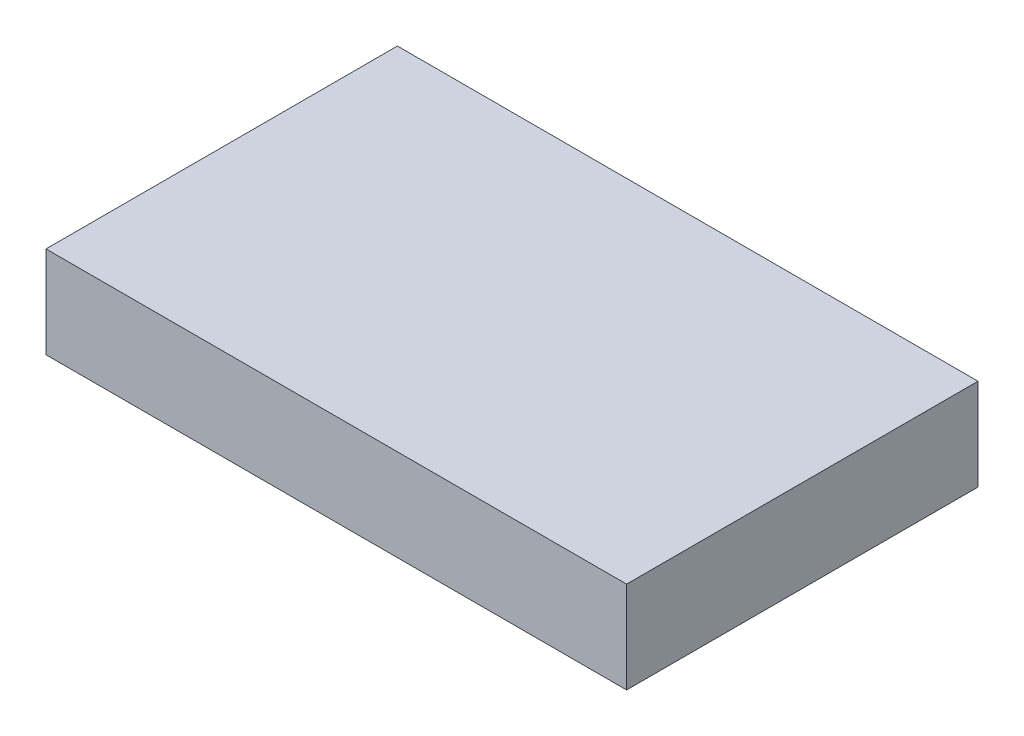
ISO-10303-21;
HEADER;
FILE_DESCRIPTION(('STEP AP214'),'2;1');
FILE_NAME('part.step','',(''),(''),'','','');
FILE_SCHEMA(('AUTOMOTIVE_DESIGN { 1 0 10303 214 1 1 1 1 }'));
ENDSEC;
DATA;
#1=APPLICATION_CONTEXT('core data for automotive mechanical design processes');
#2=APPLICATION_PROTOCOL_DEFINITION('international standard','automotive_design',2000,#1);
#3=PRODUCT_CONTEXT('',#1,'mechanical');
#4=PRODUCT('Part','Part','',(#3));
#5=PRODUCT_RELATED_PRODUCT_CATEGORY('part','',(#4));
#6=PRODUCT_DEFINITION_FORMATION('','',#4);
#7=PRODUCT_DEFINITION_CONTEXT('part definition',#1,'design');
#8=PRODUCT_DEFINITION('design','',#6,#7);
#9=PRODUCT_DEFINITION_SHAPE('','',#8);
#10=(LENGTH_UNIT() NAMED_UNIT(*) SI_UNIT(.MILLI.,.METRE.));
#11=(NAMED_UNIT(*) PLANE_ANGLE_UNIT() SI_UNIT($,.RADIAN.));
#12=(NAMED_UNIT(*) SI_UNIT($,.STERADIAN.) SOLID_ANGLE_UNIT());
#13=UNCERTAINTY_MEASURE_WITH_UNIT(LENGTH_MEASURE(1.E-05),#10,'distance_accuracy_value','');
#14=(GEOMETRIC_REPRESENTATION_CONTEXT(3) GLOBAL_UNCERTAINTY_ASSIGNED_CONTEXT((#13)) GLOBAL_UNIT_ASSIGNED_CONTEXT((#10,
#11,#12)) REPRESENTATION_CONTEXT('',''));
#15=CARTESIAN_POINT('',(0.,0.,0.));
#16=DIRECTION('',(0.,0.,1.));
#17=DIRECTION('',(1.,0.,0.));
#18=AXIS2_PLACEMENT_3D('',#15,#16,#17);
#19=CARTESIAN_POINT('',(19.,6.,11.5));
#20=DIRECTION('',(-1.,0.,0.));
#21=DIRECTION('',(0.,0.,1.));
#22=AXIS2_PLACEMENT_3D('',#19,#20,#21);
#23=PLANE('',#22);
#24=DIRECTION('',(0.,0.,-1.));
#25=VECTOR('',#24,1.);
#26=CARTESIAN_POINT('',(19.,0.,11.5));
#27=LINE('',#26,#25);
#28=CARTESIAN_POINT('',(19.,0.,11.5));
#29=VERTEX_POINT('',#28);
#30=CARTESIAN_POINT('',(19.,0.,-11.5));
#31=VERTEX_POINT('',#30);
#32=EDGE_CURVE('E96',#29,#31,#27,.T.);
#33=ORIENTED_EDGE('',*,*,#32,.T.);
#34=DIRECTION('',(0.,-1.,0.));
#35=VECTOR('',#34,1.);
#36=CARTESIAN_POINT('',(19.,6.,-11.5));
#37=LINE('',#36,#35);
#38=CARTESIAN_POINT('',(19.,6.,-11.5));
#39=VERTEX_POINT('',#38);
#40=EDGE_CURVE('E11',#39,#31,#37,.T.);
#41=ORIENTED_EDGE('',*,*,#40,.F.);
#42=DIRECTION('',(0.,0.,-1.));
#43=VECTOR('',#42,1.);
#44=CARTESIAN_POINT('',(19.,6.,11.5));
#45=LINE('',#44,#43);
#46=CARTESIAN_POINT('',(19.,6.,11.5));
#47=VERTEX_POINT('',#46);
#48=EDGE_CURVE('E84',#47,#39,#45,.T.);
#49=ORIENTED_EDGE('',*,*,#48,.F.);
#50=DIRECTION('',(0.,-1.,0.));
#51=VECTOR('',#50,1.);
#52=CARTESIAN_POINT('',(19.,6.,11.5));
#53=LINE('',#52,#51);
#54=EDGE_CURVE('E92',#47,#29,#53,.T.);
#55=ORIENTED_EDGE('',*,*,#54,.T.);
#56=EDGE_LOOP('',(#33,#41,#49,#55));
#57=FACE_BOUND('',#56,.T.);
#58=ADVANCED_FACE('F33',(#57),#23,.F.);
#59=CARTESIAN_POINT('',(-19.,6.,-11.5));
#60=DIRECTION('',(0.,0.,1.));
#61=DIRECTION('',(1.,0.,0.));
#62=AXIS2_PLACEMENT_3D('',#59,#60,#61);
#63=PLANE('',#62);
#64=DIRECTION('',(-1.,0.,0.));
#65=VECTOR('',#64,1.);
#66=CARTESIAN_POINT('',(-19.,0.,-11.5));
#67=LINE('',#66,#65);
#68=CARTESIAN_POINT('',(-19.,0.,-11.5));
#69=VERTEX_POINT('',#68);
#70=EDGE_CURVE('E88',#31,#69,#67,.T.);
#71=ORIENTED_EDGE('',*,*,#70,.T.);
#72=DIRECTION('',(0.,-1.,0.));
#73=VECTOR('',#72,1.);
#74=CARTESIAN_POINT('',(-19.,6.,-11.5));
#75=LINE('',#74,#73);
#76=CARTESIAN_POINT('',(-19.,6.,-11.5));
#77=VERTEX_POINT('',#76);
#78=EDGE_CURVE('E41',#77,#69,#75,.T.);
#79=ORIENTED_EDGE('',*,*,#78,.F.);
#80=DIRECTION('',(-1.,0.,0.));
#81=VECTOR('',#80,1.);
#82=CARTESIAN_POINT('',(-19.,6.,-11.5));
#83=LINE('',#82,#81);
#84=EDGE_CURVE('E79',#39,#77,#83,.T.);
#85=ORIENTED_EDGE('',*,*,#84,.F.);
#86=ORIENTED_EDGE('',*,*,#40,.T.);
#87=EDGE_LOOP('',(#71,#79,#85,#86));
#88=FACE_BOUND('',#87,.T.);
#89=ADVANCED_FACE('F87',(#88),#63,.F.);
#90=CARTESIAN_POINT('',(-19.,6.,11.5));
#91=DIRECTION('',(1.,0.,0.));
#92=DIRECTION('',(0.,0.,-1.));
#93=AXIS2_PLACEMENT_3D('',#90,#91,#92);
#94=PLANE('',#93);
#95=DIRECTION('',(0.,0.,1.));
#96=VECTOR('',#95,1.);
#97=CARTESIAN_POINT('',(-19.,0.,11.5));
#98=LINE('',#97,#96);
#99=CARTESIAN_POINT('',(-19.,0.,11.5));
#100=VERTEX_POINT('',#99);
#101=EDGE_CURVE('E66',#69,#100,#98,.T.);
#102=ORIENTED_EDGE('',*,*,#101,.T.);
#103=DIRECTION('',(0.,-1.,0.));
#104=VECTOR('',#103,1.);
#105=CARTESIAN_POINT('',(-19.,6.,11.5));
#106=LINE('',#105,#104);
#107=CARTESIAN_POINT('',(-19.,6.,11.5));
#108=VERTEX_POINT('',#107);
#109=EDGE_CURVE('E89',#108,#100,#106,.T.);
#110=ORIENTED_EDGE('',*,*,#109,.F.);
#111=DIRECTION('',(0.,0.,1.));
#112=VECTOR('',#111,1.);
#113=CARTESIAN_POINT('',(-19.,6.,11.5));
#114=LINE('',#113,#112);
#115=EDGE_CURVE('E82',#77,#108,#114,.T.);
#116=ORIENTED_EDGE('',*,*,#115,.F.);
#117=ORIENTED_EDGE('',*,*,#78,.T.);
#118=EDGE_LOOP('',(#102,#110,#116,#117));
#119=FACE_BOUND('',#118,.T.);
#120=ADVANCED_FACE('F90',(#119),#94,.F.);
#121=CARTESIAN_POINT('',(-19.,6.,11.5));
#122=DIRECTION('',(0.,0.,-1.));
#123=DIRECTION('',(-1.,0.,0.));
#124=AXIS2_PLACEMENT_3D('',#121,#122,#123);
#125=PLANE('',#124);
#126=DIRECTION('',(1.,0.,0.));
#127=VECTOR('',#126,1.);
#128=CARTESIAN_POINT('',(-19.,0.,11.5));
#129=LINE('',#128,#127);
#130=EDGE_CURVE('E72',#100,#29,#129,.T.);
#131=ORIENTED_EDGE('',*,*,#130,.T.);
#132=ORIENTED_EDGE('',*,*,#54,.F.);
#133=DIRECTION('',(1.,0.,0.));
#134=VECTOR('',#133,1.);
#135=CARTESIAN_POINT('',(-19.,6.,11.5));
#136=LINE('',#135,#134);
#137=EDGE_CURVE('E49',#108,#47,#136,.T.);
#138=ORIENTED_EDGE('',*,*,#137,.F.);
#139=ORIENTED_EDGE('',*,*,#109,.T.);
#140=EDGE_LOOP('',(#131,#132,#138,#139));
#141=FACE_BOUND('',#140,.T.);
#142=ADVANCED_FACE('F103',(#141),#125,.F.);
#143=CARTESIAN_POINT('',(0.,6.,0.));
#144=DIRECTION('',(0.,-1.,0.));
#145=DIRECTION('',(0.,0.,-1.));
#146=AXIS2_PLACEMENT_3D('',#143,#144,#145);
#147=PLANE('',#146);
#148=ORIENTED_EDGE('',*,*,#48,.T.);
#149=ORIENTED_EDGE('',*,*,#84,.T.);
#150=ORIENTED_EDGE('',*,*,#115,.T.);
#151=ORIENTED_EDGE('',*,*,#137,.T.);
#152=EDGE_LOOP('',(#148,#149,#150,#151));
#153=FACE_BOUND('',#152,.T.);
#154=ADVANCED_FACE('F80',(#153),#147,.F.);
#155=CARTESIAN_POINT('',(0.,0.,0.));
#156=DIRECTION('',(0.,-1.,0.));
#157=DIRECTION('',(0.,0.,-1.));
#158=AXIS2_PLACEMENT_3D('',#155,#156,#157);
#159=PLANE('',#158);
#160=ORIENTED_EDGE('',*,*,#32,.F.);
#161=ORIENTED_EDGE('',*,*,#130,.F.);
#162=ORIENTED_EDGE('',*,*,#101,.F.);
#163=ORIENTED_EDGE('',*,*,#70,.F.);
#164=EDGE_LOOP('',(#160,#161,#162,#163));
#165=FACE_BOUND('',#164,.T.);
#166=ADVANCED_FACE('F106',(#165),#159,.T.);
#167=CLOSED_SHELL('',(#58,#89,#120,#142,#154,#166));
#168=MANIFOLD_SOLID_BREP('B2',#167);
#169=ADVANCED_BREP_SHAPE_REPRESENTATION('',(#18,#168),#14);
#170=SHAPE_DEFINITION_REPRESENTATION(#9,#169);
ENDSEC;
END-ISO-10303-21;
